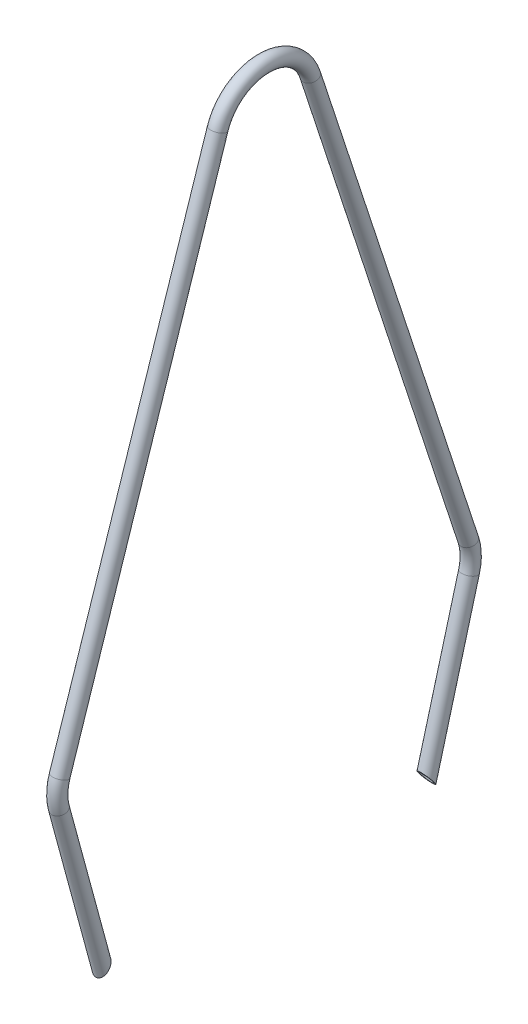
ISO-10303-21;
HEADER;
FILE_DESCRIPTION(('STEP AP214'),'2;1');
FILE_NAME('part.step','',(''),(''),'','','');
FILE_SCHEMA(('AUTOMOTIVE_DESIGN { 1 0 10303 214 1 1 1 1 }'));
ENDSEC;
DATA;
#1=APPLICATION_CONTEXT('core data for automotive mechanical design processes');
#2=APPLICATION_PROTOCOL_DEFINITION('international standard','automotive_design',2000,#1);
#3=PRODUCT_CONTEXT('',#1,'mechanical');
#4=PRODUCT('Part','Part','',(#3));
#5=PRODUCT_RELATED_PRODUCT_CATEGORY('part','',(#4));
#6=PRODUCT_DEFINITION_FORMATION('','',#4);
#7=PRODUCT_DEFINITION_CONTEXT('part definition',#1,'design');
#8=PRODUCT_DEFINITION('design','',#6,#7);
#9=PRODUCT_DEFINITION_SHAPE('','',#8);
#10=(LENGTH_UNIT() NAMED_UNIT(*) SI_UNIT(.MILLI.,.METRE.));
#11=(NAMED_UNIT(*) PLANE_ANGLE_UNIT() SI_UNIT($,.RADIAN.));
#12=(NAMED_UNIT(*) SI_UNIT($,.STERADIAN.) SOLID_ANGLE_UNIT());
#13=UNCERTAINTY_MEASURE_WITH_UNIT(LENGTH_MEASURE(1.E-05),#10,'distance_accuracy_value','');
#14=(GEOMETRIC_REPRESENTATION_CONTEXT(3) GLOBAL_UNCERTAINTY_ASSIGNED_CONTEXT((#13)) GLOBAL_UNIT_ASSIGNED_CONTEXT((#10,
#11,#12)) REPRESENTATION_CONTEXT('',''));
#15=CARTESIAN_POINT('',(0.,0.,0.));
#16=DIRECTION('',(0.,0.,1.));
#17=DIRECTION('',(1.,0.,0.));
#18=AXIS2_PLACEMENT_3D('',#15,#16,#17);
#19=CARTESIAN_POINT('',(1799.99999999996,1102.7,0.));
#20=DIRECTION('',(1.,0.,0.));
#21=DIRECTION('',(0.,0.,-1.));
#22=AXIS2_PLACEMENT_3D('',#19,#20,#21);
#23=TOROIDAL_SURFACE('',#22,82.5499999999893,9.65000000000003);
#24=CARTESIAN_POINT('',(1799.99999999996,1128.44535180018,-78.4326421885894));
#25=DIRECTION('',(0.,-0.950122861158082,-0.311875854635752));
#26=DIRECTION('',(0.,0.311875854635752,-0.950122861158082));
#27=AXIS2_PLACEMENT_3D('',#24,#25,#26);
#28=CIRCLE('',#27,9.65000000000003);
#29=CARTESIAN_POINT('',(1799.99999999996,1131.45495379741,-87.6013277987649));
#30=VERTEX_POINT('',#29);
#31=EDGE_CURVE('E53',#30,#30,#28,.T.);
#32=CARTESIAN_POINT('',(1799.99999999996,1128.44535180018,78.4326421885895));
#33=DIRECTION('',(0.,-0.950122861158082,0.31187585463575));
#34=DIRECTION('',(0.,-0.31187585463575,-0.950122861158082));
#35=AXIS2_PLACEMENT_3D('',#32,#33,#34);
#36=CIRCLE('',#35,9.65000000000003);
#37=CARTESIAN_POINT('',(1799.99999999996,1131.45495379741,87.601327798765));
#38=VERTEX_POINT('',#37);
#39=EDGE_CURVE('E10',#38,#38,#36,.T.);
#40=CARTESIAN_POINT('',(1799.99999999996,1102.7,0.));
#41=DIRECTION('',(1.,0.,0.));
#42=DIRECTION('',(0.,0.,-1.));
#43=AXIS2_PLACEMENT_3D('',#40,#41,#42);
#44=CIRCLE('',#43,92.1999999999893);
#45=EDGE_CURVE('',#30,#38,#44,.T.);
#46=ORIENTED_EDGE('',*,*,#31,.T.);
#47=ORIENTED_EDGE('',*,*,#39,.T.);
#48=ORIENTED_EDGE('',*,*,#45,.T.);
#49=ORIENTED_EDGE('',*,*,#45,.F.);
#50=EDGE_LOOP('',(#46,#48,#47,#49));
#51=FACE_BOUND('',#50,.T.);
#52=ADVANCED_FACE('F40',(#51),#23,.F.);
#53=CARTESIAN_POINT('',(1799.99999999996,1102.7,0.));
#54=DIRECTION('',(1.,0.,0.));
#55=DIRECTION('',(0.,0.,-1.));
#56=AXIS2_PLACEMENT_3D('',#53,#54,#55);
#57=TOROIDAL_SURFACE('',#56,82.5499999999893,12.7000000000001);
#58=CARTESIAN_POINT('',(1799.99999999996,1128.44535180018,-78.4326421885894));
#59=DIRECTION('',(0.,-0.950122861158082,-0.311875854635752));
#60=DIRECTION('',(0.,0.311875854635752,-0.950122861158082));
#61=AXIS2_PLACEMENT_3D('',#58,#59,#60);
#62=CIRCLE('',#61,12.7000000000001);
#63=CARTESIAN_POINT('',(1799.99999999996,1132.40617515405,-90.4992025252971));
#64=VERTEX_POINT('',#63);
#65=EDGE_CURVE('E59',#64,#64,#62,.F.);
#66=CARTESIAN_POINT('',(1799.99999999996,1128.44535180018,78.4326421885895));
#67=DIRECTION('',(0.,-0.950122861158082,0.31187585463575));
#68=DIRECTION('',(0.,-0.31187585463575,-0.950122861158082));
#69=AXIS2_PLACEMENT_3D('',#66,#67,#68);
#70=CIRCLE('',#69,12.7000000000001);
#71=CARTESIAN_POINT('',(1799.99999999996,1132.40617515405,90.4992025252972));
#72=VERTEX_POINT('',#71);
#73=EDGE_CURVE('E47',#72,#72,#70,.F.);
#74=CARTESIAN_POINT('',(1799.99999999996,1102.7,0.));
#75=DIRECTION('',(1.,0.,0.));
#76=DIRECTION('',(0.,0.,-1.));
#77=AXIS2_PLACEMENT_3D('',#74,#75,#76);
#78=CIRCLE('',#77,95.2499999999894);
#79=EDGE_CURVE('',#64,#72,#78,.T.);
#80=ORIENTED_EDGE('',*,*,#65,.T.);
#81=ORIENTED_EDGE('',*,*,#73,.T.);
#82=ORIENTED_EDGE('',*,*,#79,.T.);
#83=ORIENTED_EDGE('',*,*,#79,.F.);
#84=EDGE_LOOP('',(#80,#82,#81,#83));
#85=FACE_BOUND('',#84,.T.);
#86=ADVANCED_FACE('F141',(#85),#57,.T.);
#87=CARTESIAN_POINT('',(1799.99999999996,1128.44535180018,-78.4326421885894));
#88=DIRECTION('',(0.,-0.950122861158083,-0.311875854635749));
#89=DIRECTION('',(0.,0.311875854635749,-0.950122861158082));
#90=AXIS2_PLACEMENT_3D('',#87,#88,#89);
#91=CYLINDRICAL_SURFACE('',#90,9.65000000000003);
#92=ORIENTED_EDGE('',*,*,#31,.F.);
#93=EDGE_LOOP('',(#92));
#94=FACE_BOUND('',#93,.T.);
#95=CARTESIAN_POINT('',(1799.99999999996,313.578191864488,-345.911093985641));
#96=DIRECTION('',(0.,0.950122861158082,0.311875854635752));
#97=DIRECTION('',(0.,-0.311875854635752,0.950122861158082));
#98=AXIS2_PLACEMENT_3D('',#95,#96,#97);
#99=CIRCLE('',#98,9.65000000000003);
#100=CARTESIAN_POINT('',(1799.99999999996,316.587793861723,-355.079779595817));
#101=VERTEX_POINT('',#100);
#102=EDGE_CURVE('E74',#101,#101,#99,.F.);
#103=ORIENTED_EDGE('',*,*,#102,.T.);
#104=EDGE_LOOP('',(#103));
#105=FACE_BOUND('',#104,.T.);
#106=ADVANCED_FACE('F145',(#94,#105),#91,.F.);
#107=CARTESIAN_POINT('',(1799.99999999996,1128.44535180018,-78.4326421885894));
#108=DIRECTION('',(0.,-0.950122861158083,-0.311875854635749));
#109=DIRECTION('',(0.,0.311875854635749,-0.950122861158082));
#110=AXIS2_PLACEMENT_3D('',#107,#108,#109);
#111=CYLINDRICAL_SURFACE('',#110,12.7000000000001);
#112=ORIENTED_EDGE('',*,*,#65,.F.);
#113=EDGE_LOOP('',(#112));
#114=FACE_BOUND('',#113,.T.);
#115=CARTESIAN_POINT('',(1799.99999999996,313.578191864488,-345.911093985641));
#116=DIRECTION('',(0.,-0.950122861158082,-0.311875854635752));
#117=DIRECTION('',(0.,0.311875854635752,-0.950122861158082));
#118=AXIS2_PLACEMENT_3D('',#115,#116,#117);
#119=CIRCLE('',#118,12.7000000000001);
#120=CARTESIAN_POINT('',(1799.99999999996,317.539015218362,-357.977654322349));
#121=VERTEX_POINT('',#120);
#122=EDGE_CURVE('E65',#121,#121,#119,.T.);
#123=ORIENTED_EDGE('',*,*,#122,.F.);
#124=EDGE_LOOP('',(#123));
#125=FACE_BOUND('',#124,.T.);
#126=ADVANCED_FACE('F151',(#114,#125),#111,.T.);
#127=CARTESIAN_POINT('',(1799.99999999996,287.832840064307,-267.478451797042));
#128=DIRECTION('',(-1.,0.,0.));
#129=DIRECTION('',(0.,0.,1.));
#130=AXIS2_PLACEMENT_3D('',#127,#128,#129);
#131=TOROIDAL_SURFACE('',#130,82.55,9.65000000000003);
#132=CARTESIAN_POINT('',(1799.99999999996,266.239692896315,-347.154285619986));
#133=DIRECTION('',(0.,-0.965182723476006,0.261576585923587));
#134=DIRECTION('',(0.,-0.261576585923587,-0.965182723476006));
#135=AXIS2_PLACEMENT_3D('',#132,#133,#134);
#136=CIRCLE('',#135,9.65000000000003);
#137=CARTESIAN_POINT('',(1799.99999999996,263.715478842152,-356.468298901529));
#138=VERTEX_POINT('',#137);
#139=EDGE_CURVE('E69',#138,#138,#136,.F.);
#140=CARTESIAN_POINT('',(1799.99999999996,287.832840064307,-267.478451797042));
#141=DIRECTION('',(-1.,0.,0.));
#142=DIRECTION('',(0.,0.,1.));
#143=AXIS2_PLACEMENT_3D('',#140,#141,#142);
#144=CIRCLE('',#143,92.2);
#145=EDGE_CURVE('',#101,#138,#144,.T.);
#146=ORIENTED_EDGE('',*,*,#102,.F.);
#147=ORIENTED_EDGE('',*,*,#139,.F.);
#148=ORIENTED_EDGE('',*,*,#145,.T.);
#149=ORIENTED_EDGE('',*,*,#145,.F.);
#150=EDGE_LOOP('',(#146,#148,#147,#149));
#151=FACE_BOUND('',#150,.T.);
#152=ADVANCED_FACE('F155',(#151),#131,.F.);
#153=CARTESIAN_POINT('',(1799.99999999996,287.832840064307,-267.478451797042));
#154=DIRECTION('',(-1.,0.,0.));
#155=DIRECTION('',(0.,0.,1.));
#156=AXIS2_PLACEMENT_3D('',#153,#154,#155);
#157=TOROIDAL_SURFACE('',#156,82.55,12.7000000000001);
#158=CARTESIAN_POINT('',(1799.99999999996,266.239692896315,-347.154285619986));
#159=DIRECTION('',(0.,-0.965182723476006,0.261576585923587));
#160=DIRECTION('',(0.,-0.261576585923587,-0.965182723476006));
#161=AXIS2_PLACEMENT_3D('',#158,#159,#160);
#162=CIRCLE('',#161,12.7000000000001);
#163=CARTESIAN_POINT('',(1799.99999999996,262.917670255085,-359.412106208131));
#164=VERTEX_POINT('',#163);
#165=EDGE_CURVE('E73',#164,#164,#162,.T.);
#166=CARTESIAN_POINT('',(1799.99999999996,287.832840064307,-267.478451797042));
#167=DIRECTION('',(-1.,0.,0.));
#168=DIRECTION('',(0.,0.,1.));
#169=AXIS2_PLACEMENT_3D('',#166,#167,#168);
#170=CIRCLE('',#169,95.2500000000001);
#171=EDGE_CURVE('',#121,#164,#170,.T.);
#172=ORIENTED_EDGE('',*,*,#122,.T.);
#173=ORIENTED_EDGE('',*,*,#165,.F.);
#174=ORIENTED_EDGE('',*,*,#171,.T.);
#175=ORIENTED_EDGE('',*,*,#171,.F.);
#176=EDGE_LOOP('',(#172,#174,#173,#175));
#177=FACE_BOUND('',#176,.T.);
#178=ADVANCED_FACE('F158',(#177),#157,.T.);
#179=CARTESIAN_POINT('',(1799.99999999996,266.239692896315,-347.154285619986));
#180=DIRECTION('',(0.,-0.965182723476007,0.261576585923584));
#181=DIRECTION('',(0.,-0.261576585923584,-0.965182723476007));
#182=AXIS2_PLACEMENT_3D('',#179,#180,#181);
#183=CYLINDRICAL_SURFACE('',#182,9.65000000000003);
#184=ORIENTED_EDGE('',*,*,#139,.T.);
#185=EDGE_LOOP('',(#184));
#186=FACE_BOUND('',#185,.T.);
#187=CARTESIAN_POINT('',(1799.99999999996,-3.99680288865056E-12,-275.000000000001));
#188=DIRECTION('',(0.,-0.607627934708573,0.794221815969439));
#189=DIRECTION('',(0.,-0.794221815969439,-0.607627934708573));
#190=AXIS2_PLACEMENT_3D('',#187,#188,#189);
#191=ELLIPSE('',#190,12.1502580336718,9.65000000000003);
#192=CARTESIAN_POINT('',(1799.99999999996,-9.65000000000405,-282.382836195177));
#193=VERTEX_POINT('',#192);
#194=EDGE_CURVE('E82',#193,#193,#191,.T.);
#195=ORIENTED_EDGE('',*,*,#194,.T.);
#196=EDGE_LOOP('',(#195));
#197=FACE_BOUND('',#196,.T.);
#198=ADVANCED_FACE('F162',(#186,#197),#183,.F.);
#199=CARTESIAN_POINT('',(1799.99999999996,266.239692896315,-347.154285619986));
#200=DIRECTION('',(0.,-0.965182723476007,0.261576585923584));
#201=DIRECTION('',(0.,-0.261576585923584,-0.965182723476007));
#202=AXIS2_PLACEMENT_3D('',#199,#200,#201);
#203=CYLINDRICAL_SURFACE('',#202,12.7000000000001);
#204=ORIENTED_EDGE('',*,*,#165,.T.);
#205=EDGE_LOOP('',(#204));
#206=FACE_BOUND('',#205,.T.);
#207=CARTESIAN_POINT('',(1799.99999999996,-3.99680288865056E-12,-275.000000000001));
#208=DIRECTION('',(0.,-0.607627934708573,0.794221815969439));
#209=DIRECTION('',(0.,-0.794221815969439,-0.607627934708573));
#210=AXIS2_PLACEMENT_3D('',#207,#208,#209);
#211=ELLIPSE('',#210,15.9904950287702,12.7000000000001);
#212=CARTESIAN_POINT('',(1799.99999999996,-12.7000000000041,-284.7162714693));
#213=VERTEX_POINT('',#212);
#214=EDGE_CURVE('E78',#213,#213,#211,.T.);
#215=ORIENTED_EDGE('',*,*,#214,.F.);
#216=EDGE_LOOP('',(#215));
#217=FACE_BOUND('',#216,.T.);
#218=ADVANCED_FACE('F137',(#206,#217),#203,.T.);
#219=CARTESIAN_POINT('',(1799.99999999996,-3.99680288865056E-12,-275.000000000001));
#220=DIRECTION('',(0.,-0.607627934708573,0.794221815969439));
#221=DIRECTION('',(0.,-0.794221815969439,-0.607627934708573));
#222=AXIS2_PLACEMENT_3D('',#219,#220,#221);
#223=PLANE('',#222);
#224=ORIENTED_EDGE('',*,*,#194,.F.);
#225=EDGE_LOOP('',(#224));
#226=FACE_BOUND('',#225,.T.);
#227=ORIENTED_EDGE('',*,*,#214,.T.);
#228=EDGE_LOOP('',(#227));
#229=FACE_BOUND('',#228,.T.);
#230=ADVANCED_FACE('F129',(#226,#229),#223,.T.);
#231=CARTESIAN_POINT('',(1799.99999999996,313.578191864488,345.911093985641));
#232=DIRECTION('',(0.,0.950122861158082,-0.31187585463575));
#233=DIRECTION('',(0.,0.31187585463575,0.950122861158083));
#234=AXIS2_PLACEMENT_3D('',#231,#232,#233);
#235=CYLINDRICAL_SURFACE('',#234,9.65000000000003);
#236=CARTESIAN_POINT('',(1799.99999999996,313.578191864488,345.911093985641));
#237=DIRECTION('',(0.,0.950122861158083,-0.31187585463575));
#238=DIRECTION('',(0.,0.31187585463575,0.950122861158082));
#239=AXIS2_PLACEMENT_3D('',#236,#237,#238);
#240=CIRCLE('',#239,9.65000000000003);
#241=CARTESIAN_POINT('',(1799.99999999996,316.587793861723,355.079779595817));
#242=VERTEX_POINT('',#241);
#243=EDGE_CURVE('E93',#242,#242,#240,.T.);
#244=ORIENTED_EDGE('',*,*,#243,.F.);
#245=EDGE_LOOP('',(#244));
#246=FACE_BOUND('',#245,.T.);
#247=ORIENTED_EDGE('',*,*,#39,.F.);
#248=EDGE_LOOP('',(#247));
#249=FACE_BOUND('',#248,.T.);
#250=ADVANCED_FACE('F126',(#246,#249),#235,.F.);
#251=CARTESIAN_POINT('',(1799.99999999996,313.578191864488,345.911093985641));
#252=DIRECTION('',(0.,0.950122861158082,-0.31187585463575));
#253=DIRECTION('',(0.,0.31187585463575,0.950122861158083));
#254=AXIS2_PLACEMENT_3D('',#251,#252,#253);
#255=CYLINDRICAL_SURFACE('',#254,12.7000000000001);
#256=CARTESIAN_POINT('',(1799.99999999996,313.578191864488,345.911093985641));
#257=DIRECTION('',(0.,-0.950122861158083,0.31187585463575));
#258=DIRECTION('',(0.,-0.31187585463575,-0.950122861158082));
#259=AXIS2_PLACEMENT_3D('',#256,#257,#258);
#260=CIRCLE('',#259,12.7000000000001);
#261=CARTESIAN_POINT('',(1799.99999999996,317.539015218362,357.977654322349));
#262=VERTEX_POINT('',#261);
#263=EDGE_CURVE('E86',#262,#262,#260,.T.);
#264=ORIENTED_EDGE('',*,*,#263,.F.);
#265=EDGE_LOOP('',(#264));
#266=FACE_BOUND('',#265,.T.);
#267=ORIENTED_EDGE('',*,*,#73,.F.);
#268=EDGE_LOOP('',(#267));
#269=FACE_BOUND('',#268,.T.);
#270=ADVANCED_FACE('F122',(#266,#269),#255,.T.);
#271=CARTESIAN_POINT('',(1799.99999999996,287.832840064307,267.478451797042));
#272=DIRECTION('',(1.,0.,0.));
#273=DIRECTION('',(0.,0.,-1.));
#274=AXIS2_PLACEMENT_3D('',#271,#272,#273);
#275=TOROIDAL_SURFACE('',#274,82.5499999999994,9.65000000000003);
#276=CARTESIAN_POINT('',(1799.99999999996,266.239692896315,347.154285619986));
#277=DIRECTION('',(0.,0.965182723476006,0.261576585923589));
#278=DIRECTION('',(0.,-0.261576585923589,0.965182723476005));
#279=AXIS2_PLACEMENT_3D('',#276,#277,#278);
#280=CIRCLE('',#279,9.65000000000003);
#281=CARTESIAN_POINT('',(1799.99999999996,263.715478842152,356.468298901529));
#282=VERTEX_POINT('',#281);
#283=EDGE_CURVE('E103',#282,#282,#280,.T.);
#284=CARTESIAN_POINT('',(1799.99999999996,287.832840064307,267.478451797042));
#285=DIRECTION('',(1.,0.,0.));
#286=DIRECTION('',(0.,0.,-1.));
#287=AXIS2_PLACEMENT_3D('',#284,#285,#286);
#288=CIRCLE('',#287,92.1999999999995);
#289=EDGE_CURVE('',#242,#282,#288,.T.);
#290=ORIENTED_EDGE('',*,*,#243,.T.);
#291=ORIENTED_EDGE('',*,*,#283,.F.);
#292=ORIENTED_EDGE('',*,*,#289,.T.);
#293=ORIENTED_EDGE('',*,*,#289,.F.);
#294=EDGE_LOOP('',(#290,#292,#291,#293));
#295=FACE_BOUND('',#294,.T.);
#296=ADVANCED_FACE('F118',(#295),#275,.F.);
#297=CARTESIAN_POINT('',(1799.99999999996,287.832840064307,267.478451797042));
#298=DIRECTION('',(1.,0.,0.));
#299=DIRECTION('',(0.,0.,-1.));
#300=AXIS2_PLACEMENT_3D('',#297,#298,#299);
#301=TOROIDAL_SURFACE('',#300,82.5499999999994,12.7000000000001);
#302=CARTESIAN_POINT('',(1799.99999999996,266.239692896315,347.154285619986));
#303=DIRECTION('',(0.,0.965182723476006,0.261576585923589));
#304=DIRECTION('',(0.,-0.261576585923589,0.965182723476005));
#305=AXIS2_PLACEMENT_3D('',#302,#303,#304);
#306=CIRCLE('',#305,12.7000000000001);
#307=CARTESIAN_POINT('',(1799.99999999996,262.917670255085,359.412106208131));
#308=VERTEX_POINT('',#307);
#309=EDGE_CURVE('E102',#308,#308,#306,.T.);
#310=CARTESIAN_POINT('',(1799.99999999996,287.832840064307,267.478451797042));
#311=DIRECTION('',(1.,0.,0.));
#312=DIRECTION('',(0.,0.,-1.));
#313=AXIS2_PLACEMENT_3D('',#310,#311,#312);
#314=CIRCLE('',#313,95.2499999999995);
#315=EDGE_CURVE('',#262,#308,#314,.T.);
#316=ORIENTED_EDGE('',*,*,#263,.T.);
#317=ORIENTED_EDGE('',*,*,#309,.T.);
#318=ORIENTED_EDGE('',*,*,#315,.T.);
#319=ORIENTED_EDGE('',*,*,#315,.F.);
#320=EDGE_LOOP('',(#316,#318,#317,#319));
#321=FACE_BOUND('',#320,.T.);
#322=ADVANCED_FACE('F121',(#321),#301,.T.);
#323=CARTESIAN_POINT('',(1799.99999999996,-4.21884749357559E-12,275.));
#324=DIRECTION('',(0.,0.965182723476006,0.261576585923588));
#325=DIRECTION('',(0.,-0.261576585923588,0.965182723476006));
#326=AXIS2_PLACEMENT_3D('',#323,#324,#325);
#327=CYLINDRICAL_SURFACE('',#326,9.65000000000003);
#328=ORIENTED_EDGE('',*,*,#283,.T.);
#329=EDGE_LOOP('',(#328));
#330=FACE_BOUND('',#329,.T.);
#331=CARTESIAN_POINT('',(1799.99999999996,-4.10782519111308E-12,275.));
#332=DIRECTION('',(0.,-0.607627934708573,-0.79422181596944));
#333=DIRECTION('',(0.,0.79422181596944,-0.607627934708573));
#334=AXIS2_PLACEMENT_3D('',#331,#332,#333);
#335=ELLIPSE('',#334,12.1502580336717,9.65000000000003);
#336=CARTESIAN_POINT('',(1799.99999999996,9.64999999999594,267.617163804824));
#337=VERTEX_POINT('',#336);
#338=EDGE_CURVE('E98',#337,#337,#335,.T.);
#339=ORIENTED_EDGE('',*,*,#338,.T.);
#340=EDGE_LOOP('',(#339));
#341=FACE_BOUND('',#340,.T.);
#342=ADVANCED_FACE('F115',(#330,#341),#327,.F.);
#343=CARTESIAN_POINT('',(1799.99999999996,-4.21884749357559E-12,275.));
#344=DIRECTION('',(0.,0.965182723476006,0.261576585923588));
#345=DIRECTION('',(0.,-0.261576585923588,0.965182723476006));
#346=AXIS2_PLACEMENT_3D('',#343,#344,#345);
#347=CYLINDRICAL_SURFACE('',#346,12.7000000000001);
#348=ORIENTED_EDGE('',*,*,#309,.F.);
#349=EDGE_LOOP('',(#348));
#350=FACE_BOUND('',#349,.T.);
#351=CARTESIAN_POINT('',(1799.99999999996,-4.10782519111308E-12,275.));
#352=DIRECTION('',(0.,-0.607627934708573,-0.79422181596944));
#353=DIRECTION('',(0.,0.79422181596944,-0.607627934708573));
#354=AXIS2_PLACEMENT_3D('',#351,#352,#353);
#355=ELLIPSE('',#354,15.9904950287701,12.7000000000001);
#356=CARTESIAN_POINT('',(1799.99999999996,12.699999999996,265.283728530701));
#357=VERTEX_POINT('',#356);
#358=EDGE_CURVE('E97',#357,#357,#355,.T.);
#359=ORIENTED_EDGE('',*,*,#358,.F.);
#360=EDGE_LOOP('',(#359));
#361=FACE_BOUND('',#360,.T.);
#362=ADVANCED_FACE('F259',(#350,#361),#347,.T.);
#363=CARTESIAN_POINT('',(1799.99999999996,-4.10782519111308E-12,275.));
#364=DIRECTION('',(0.,-0.607627934708573,-0.79422181596944));
#365=DIRECTION('',(0.,0.79422181596944,-0.607627934708573));
#366=AXIS2_PLACEMENT_3D('',#363,#364,#365);
#367=PLANE('',#366);
#368=ORIENTED_EDGE('',*,*,#338,.F.);
#369=EDGE_LOOP('',(#368));
#370=FACE_BOUND('',#369,.T.);
#371=ORIENTED_EDGE('',*,*,#358,.T.);
#372=EDGE_LOOP('',(#371));
#373=FACE_BOUND('',#372,.T.);
#374=ADVANCED_FACE('F269',(#370,#373),#367,.T.);
#375=CLOSED_SHELL('',(#52,#86,#106,#126,#152,#178,#198,#218,#230,#250,#270,#296,#322,#342,#362,#374));
#376=MANIFOLD_SOLID_BREP('B2',#375);
#377=ADVANCED_BREP_SHAPE_REPRESENTATION('',(#18,#376),#14);
#378=SHAPE_DEFINITION_REPRESENTATION(#9,#377);
ENDSEC;
END-ISO-10303-21;
